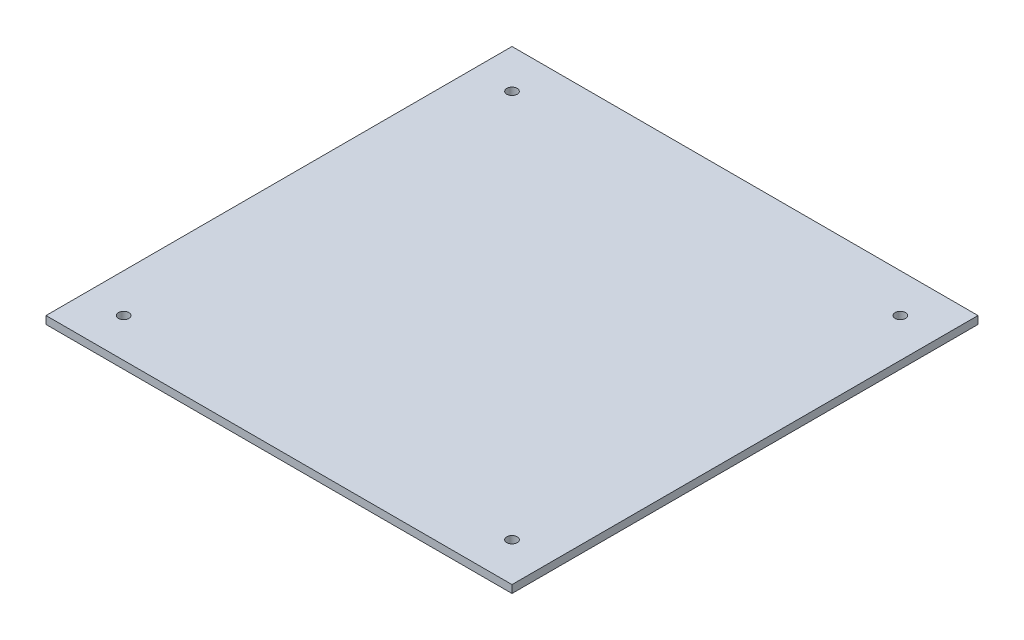
ISO-10303-21;
HEADER;
FILE_DESCRIPTION(('STEP AP214'),'2;1');
FILE_NAME('part.step','',(''),(''),'','','');
FILE_SCHEMA(('AUTOMOTIVE_DESIGN { 1 0 10303 214 1 1 1 1 }'));
ENDSEC;
DATA;
#1=APPLICATION_CONTEXT('core data for automotive mechanical design processes');
#2=APPLICATION_PROTOCOL_DEFINITION('international standard','automotive_design',2000,#1);
#3=PRODUCT_CONTEXT('',#1,'mechanical');
#4=PRODUCT('Part','Part','',(#3));
#5=PRODUCT_RELATED_PRODUCT_CATEGORY('part','',(#4));
#6=PRODUCT_DEFINITION_FORMATION('','',#4);
#7=PRODUCT_DEFINITION_CONTEXT('part definition',#1,'design');
#8=PRODUCT_DEFINITION('design','',#6,#7);
#9=PRODUCT_DEFINITION_SHAPE('','',#8);
#10=(LENGTH_UNIT() NAMED_UNIT(*) SI_UNIT(.MILLI.,.METRE.));
#11=(NAMED_UNIT(*) PLANE_ANGLE_UNIT() SI_UNIT($,.RADIAN.));
#12=(NAMED_UNIT(*) SI_UNIT($,.STERADIAN.) SOLID_ANGLE_UNIT());
#13=UNCERTAINTY_MEASURE_WITH_UNIT(LENGTH_MEASURE(1.E-05),#10,'distance_accuracy_value','');
#14=(GEOMETRIC_REPRESENTATION_CONTEXT(3) GLOBAL_UNCERTAINTY_ASSIGNED_CONTEXT((#13)) GLOBAL_UNIT_ASSIGNED_CONTEXT((#10,
#11,#12)) REPRESENTATION_CONTEXT('',''));
#15=CARTESIAN_POINT('',(0.,0.,0.));
#16=DIRECTION('',(0.,0.,1.));
#17=DIRECTION('',(1.,0.,0.));
#18=AXIS2_PLACEMENT_3D('',#15,#16,#17);
#19=CARTESIAN_POINT('',(0.,3.,0.));
#20=DIRECTION('',(0.,1.,0.));
#21=DIRECTION('',(0.,0.,1.));
#22=AXIS2_PLACEMENT_3D('',#19,#20,#21);
#23=PLANE('',#22);
#24=CARTESIAN_POINT('',(-74.9999999999999,3.,75.));
#25=DIRECTION('',(0.,1.,0.));
#26=DIRECTION('',(0.,0.,1.));
#27=AXIS2_PLACEMENT_3D('',#24,#25,#26);
#28=CIRCLE('',#27,2.);
#29=CARTESIAN_POINT('',(-74.9999999999999,3.,77.));
#30=VERTEX_POINT('',#29);
#31=EDGE_CURVE('E142',#30,#30,#28,.T.);
#32=ORIENTED_EDGE('',*,*,#31,.F.);
#33=EDGE_LOOP('',(#32));
#34=FACE_BOUND('',#33,.T.);
#35=CARTESIAN_POINT('',(-75.,3.,-75.));
#36=DIRECTION('',(0.,1.,0.));
#37=DIRECTION('',(0.,0.,1.));
#38=AXIS2_PLACEMENT_3D('',#35,#36,#37);
#39=CIRCLE('',#38,2.);
#40=CARTESIAN_POINT('',(-75.,3.,-73.));
#41=VERTEX_POINT('',#40);
#42=EDGE_CURVE('E112',#41,#41,#39,.T.);
#43=ORIENTED_EDGE('',*,*,#42,.F.);
#44=EDGE_LOOP('',(#43));
#45=FACE_BOUND('',#44,.T.);
#46=DIRECTION('',(0.,0.,1.));
#47=VECTOR('',#46,1.);
#48=CARTESIAN_POINT('',(-90.,3.,90.));
#49=LINE('',#48,#47);
#50=CARTESIAN_POINT('',(-90.,3.,-90.));
#51=VERTEX_POINT('',#50);
#52=CARTESIAN_POINT('',(-90.,3.,90.));
#53=VERTEX_POINT('',#52);
#54=EDGE_CURVE('E92',#51,#53,#49,.T.);
#55=ORIENTED_EDGE('',*,*,#54,.T.);
#56=DIRECTION('',(1.,0.,0.));
#57=VECTOR('',#56,1.);
#58=CARTESIAN_POINT('',(90.,3.,90.));
#59=LINE('',#58,#57);
#60=CARTESIAN_POINT('',(90.,3.,90.));
#61=VERTEX_POINT('',#60);
#62=EDGE_CURVE('E87',#53,#61,#59,.T.);
#63=ORIENTED_EDGE('',*,*,#62,.T.);
#64=DIRECTION('',(0.,0.,-1.));
#65=VECTOR('',#64,1.);
#66=CARTESIAN_POINT('',(90.,3.,90.));
#67=LINE('',#66,#65);
#68=CARTESIAN_POINT('',(90.,3.,-90.));
#69=VERTEX_POINT('',#68);
#70=EDGE_CURVE('E90',#61,#69,#67,.T.);
#71=ORIENTED_EDGE('',*,*,#70,.T.);
#72=DIRECTION('',(-1.,0.,0.));
#73=VECTOR('',#72,1.);
#74=CARTESIAN_POINT('',(90.,3.,-90.));
#75=LINE('',#74,#73);
#76=EDGE_CURVE('E57',#69,#51,#75,.T.);
#77=ORIENTED_EDGE('',*,*,#76,.T.);
#78=EDGE_LOOP('',(#55,#63,#71,#77));
#79=FACE_BOUND('',#78,.T.);
#80=CARTESIAN_POINT('',(75.,3.,-75.));
#81=DIRECTION('',(0.,1.,0.));
#82=DIRECTION('',(0.,0.,1.));
#83=AXIS2_PLACEMENT_3D('',#80,#81,#82);
#84=CIRCLE('',#83,2.);
#85=CARTESIAN_POINT('',(75.,3.,-73.));
#86=VERTEX_POINT('',#85);
#87=EDGE_CURVE('E134',#86,#86,#84,.T.);
#88=ORIENTED_EDGE('',*,*,#87,.F.);
#89=EDGE_LOOP('',(#88));
#90=FACE_BOUND('',#89,.T.);
#91=CARTESIAN_POINT('',(75.,3.,75.));
#92=DIRECTION('',(0.,1.,0.));
#93=DIRECTION('',(0.,0.,1.));
#94=AXIS2_PLACEMENT_3D('',#91,#92,#93);
#95=CIRCLE('',#94,2.);
#96=CARTESIAN_POINT('',(75.,3.,77.));
#97=VERTEX_POINT('',#96);
#98=EDGE_CURVE('E150',#97,#97,#95,.T.);
#99=ORIENTED_EDGE('',*,*,#98,.F.);
#100=EDGE_LOOP('',(#99));
#101=FACE_BOUND('',#100,.T.);
#102=ADVANCED_FACE('F39',(#34,#45,#79,#90,#101),#23,.T.);
#103=CARTESIAN_POINT('',(0.,0.,0.));
#104=DIRECTION('',(0.,1.,0.));
#105=DIRECTION('',(0.,0.,1.));
#106=AXIS2_PLACEMENT_3D('',#103,#104,#105);
#107=PLANE('',#106);
#108=DIRECTION('',(0.,0.,1.));
#109=VECTOR('',#108,1.);
#110=CARTESIAN_POINT('',(-90.,0.,90.));
#111=LINE('',#110,#109);
#112=CARTESIAN_POINT('',(-90.,0.,-90.));
#113=VERTEX_POINT('',#112);
#114=CARTESIAN_POINT('',(-90.,0.,90.));
#115=VERTEX_POINT('',#114);
#116=EDGE_CURVE('E108',#113,#115,#111,.T.);
#117=ORIENTED_EDGE('',*,*,#116,.F.);
#118=DIRECTION('',(-1.,0.,0.));
#119=VECTOR('',#118,1.);
#120=CARTESIAN_POINT('',(90.,0.,-90.));
#121=LINE('',#120,#119);
#122=CARTESIAN_POINT('',(90.,0.,-90.));
#123=VERTEX_POINT('',#122);
#124=EDGE_CURVE('E80',#123,#113,#121,.T.);
#125=ORIENTED_EDGE('',*,*,#124,.F.);
#126=DIRECTION('',(0.,0.,-1.));
#127=VECTOR('',#126,1.);
#128=CARTESIAN_POINT('',(90.,0.,90.));
#129=LINE('',#128,#127);
#130=CARTESIAN_POINT('',(90.,0.,90.));
#131=VERTEX_POINT('',#130);
#132=EDGE_CURVE('E74',#131,#123,#129,.T.);
#133=ORIENTED_EDGE('',*,*,#132,.F.);
#134=DIRECTION('',(1.,0.,0.));
#135=VECTOR('',#134,1.);
#136=CARTESIAN_POINT('',(90.,0.,90.));
#137=LINE('',#136,#135);
#138=EDGE_CURVE('E97',#115,#131,#137,.T.);
#139=ORIENTED_EDGE('',*,*,#138,.F.);
#140=EDGE_LOOP('',(#117,#125,#133,#139));
#141=FACE_BOUND('',#140,.T.);
#142=CARTESIAN_POINT('',(-75.,0.,-75.));
#143=DIRECTION('',(0.,1.,0.));
#144=DIRECTION('',(0.,0.,1.));
#145=AXIS2_PLACEMENT_3D('',#142,#143,#144);
#146=CIRCLE('',#145,2.);
#147=CARTESIAN_POINT('',(-75.,0.,-73.));
#148=VERTEX_POINT('',#147);
#149=EDGE_CURVE('E130',#148,#148,#146,.T.);
#150=ORIENTED_EDGE('',*,*,#149,.T.);
#151=EDGE_LOOP('',(#150));
#152=FACE_BOUND('',#151,.T.);
#153=CARTESIAN_POINT('',(75.,0.,-75.));
#154=DIRECTION('',(0.,1.,0.));
#155=DIRECTION('',(0.,0.,1.));
#156=AXIS2_PLACEMENT_3D('',#153,#154,#155);
#157=CIRCLE('',#156,2.);
#158=CARTESIAN_POINT('',(75.,0.,-73.));
#159=VERTEX_POINT('',#158);
#160=EDGE_CURVE('E138',#159,#159,#157,.T.);
#161=ORIENTED_EDGE('',*,*,#160,.T.);
#162=EDGE_LOOP('',(#161));
#163=FACE_BOUND('',#162,.T.);
#164=CARTESIAN_POINT('',(-74.9999999999999,0.,75.));
#165=DIRECTION('',(0.,1.,0.));
#166=DIRECTION('',(0.,0.,1.));
#167=AXIS2_PLACEMENT_3D('',#164,#165,#166);
#168=CIRCLE('',#167,2.);
#169=CARTESIAN_POINT('',(-74.9999999999999,0.,77.));
#170=VERTEX_POINT('',#169);
#171=EDGE_CURVE('E146',#170,#170,#168,.T.);
#172=ORIENTED_EDGE('',*,*,#171,.T.);
#173=EDGE_LOOP('',(#172));
#174=FACE_BOUND('',#173,.T.);
#175=CARTESIAN_POINT('',(75.,0.,75.));
#176=DIRECTION('',(0.,1.,0.));
#177=DIRECTION('',(0.,0.,1.));
#178=AXIS2_PLACEMENT_3D('',#175,#176,#177);
#179=CIRCLE('',#178,2.);
#180=CARTESIAN_POINT('',(75.,0.,77.));
#181=VERTEX_POINT('',#180);
#182=EDGE_CURVE('E154',#181,#181,#179,.T.);
#183=ORIENTED_EDGE('',*,*,#182,.T.);
#184=EDGE_LOOP('',(#183));
#185=FACE_BOUND('',#184,.T.);
#186=ADVANCED_FACE('F125',(#141,#152,#163,#174,#185),#107,.F.);
#187=CARTESIAN_POINT('',(-90.,3.,90.));
#188=DIRECTION('',(1.,0.,0.));
#189=DIRECTION('',(0.,0.,-1.));
#190=AXIS2_PLACEMENT_3D('',#187,#188,#189);
#191=PLANE('',#190);
#192=ORIENTED_EDGE('',*,*,#116,.T.);
#193=DIRECTION('',(0.,-1.,0.));
#194=VECTOR('',#193,1.);
#195=CARTESIAN_POINT('',(-90.,3.,90.));
#196=LINE('',#195,#194);
#197=EDGE_CURVE('E11',#53,#115,#196,.T.);
#198=ORIENTED_EDGE('',*,*,#197,.F.);
#199=ORIENTED_EDGE('',*,*,#54,.F.);
#200=DIRECTION('',(0.,-1.,0.));
#201=VECTOR('',#200,1.);
#202=CARTESIAN_POINT('',(-90.,3.,-90.));
#203=LINE('',#202,#201);
#204=EDGE_CURVE('E104',#51,#113,#203,.T.);
#205=ORIENTED_EDGE('',*,*,#204,.T.);
#206=EDGE_LOOP('',(#192,#198,#199,#205));
#207=FACE_BOUND('',#206,.T.);
#208=ADVANCED_FACE('F41',(#207),#191,.F.);
#209=CARTESIAN_POINT('',(90.,3.,90.));
#210=DIRECTION('',(0.,0.,-1.));
#211=DIRECTION('',(-1.,0.,0.));
#212=AXIS2_PLACEMENT_3D('',#209,#210,#211);
#213=PLANE('',#212);
#214=ORIENTED_EDGE('',*,*,#138,.T.);
#215=DIRECTION('',(0.,-1.,0.));
#216=VECTOR('',#215,1.);
#217=CARTESIAN_POINT('',(90.,3.,90.));
#218=LINE('',#217,#216);
#219=EDGE_CURVE('E49',#61,#131,#218,.T.);
#220=ORIENTED_EDGE('',*,*,#219,.F.);
#221=ORIENTED_EDGE('',*,*,#62,.F.);
#222=ORIENTED_EDGE('',*,*,#197,.T.);
#223=EDGE_LOOP('',(#214,#220,#221,#222));
#224=FACE_BOUND('',#223,.T.);
#225=ADVANCED_FACE('F96',(#224),#213,.F.);
#226=CARTESIAN_POINT('',(90.,3.,90.));
#227=DIRECTION('',(-1.,0.,0.));
#228=DIRECTION('',(0.,0.,1.));
#229=AXIS2_PLACEMENT_3D('',#226,#227,#228);
#230=PLANE('',#229);
#231=ORIENTED_EDGE('',*,*,#132,.T.);
#232=DIRECTION('',(0.,-1.,0.));
#233=VECTOR('',#232,1.);
#234=CARTESIAN_POINT('',(90.,3.,-90.));
#235=LINE('',#234,#233);
#236=EDGE_CURVE('E99',#69,#123,#235,.T.);
#237=ORIENTED_EDGE('',*,*,#236,.F.);
#238=ORIENTED_EDGE('',*,*,#70,.F.);
#239=ORIENTED_EDGE('',*,*,#219,.T.);
#240=EDGE_LOOP('',(#231,#237,#238,#239));
#241=FACE_BOUND('',#240,.T.);
#242=ADVANCED_FACE('F100',(#241),#230,.F.);
#243=CARTESIAN_POINT('',(90.,3.,-90.));
#244=DIRECTION('',(0.,0.,1.));
#245=DIRECTION('',(1.,0.,0.));
#246=AXIS2_PLACEMENT_3D('',#243,#244,#245);
#247=PLANE('',#246);
#248=ORIENTED_EDGE('',*,*,#124,.T.);
#249=ORIENTED_EDGE('',*,*,#204,.F.);
#250=ORIENTED_EDGE('',*,*,#76,.F.);
#251=ORIENTED_EDGE('',*,*,#236,.T.);
#252=EDGE_LOOP('',(#248,#249,#250,#251));
#253=FACE_BOUND('',#252,.T.);
#254=ADVANCED_FACE('F122',(#253),#247,.F.);
#255=CARTESIAN_POINT('',(-75.,3.,-75.));
#256=DIRECTION('',(0.,-1.,0.));
#257=DIRECTION('',(0.,0.,-1.));
#258=AXIS2_PLACEMENT_3D('',#255,#256,#257);
#259=CYLINDRICAL_SURFACE('',#258,2.);
#260=ORIENTED_EDGE('',*,*,#42,.T.);
#261=EDGE_LOOP('',(#260));
#262=FACE_BOUND('',#261,.T.);
#263=ORIENTED_EDGE('',*,*,#149,.F.);
#264=EDGE_LOOP('',(#263));
#265=FACE_BOUND('',#264,.T.);
#266=ADVANCED_FACE('F175',(#262,#265),#259,.F.);
#267=CARTESIAN_POINT('',(75.,3.,-75.));
#268=DIRECTION('',(0.,-1.,0.));
#269=DIRECTION('',(0.,0.,-1.));
#270=AXIS2_PLACEMENT_3D('',#267,#268,#269);
#271=CYLINDRICAL_SURFACE('',#270,2.);
#272=ORIENTED_EDGE('',*,*,#87,.T.);
#273=EDGE_LOOP('',(#272));
#274=FACE_BOUND('',#273,.T.);
#275=ORIENTED_EDGE('',*,*,#160,.F.);
#276=EDGE_LOOP('',(#275));
#277=FACE_BOUND('',#276,.T.);
#278=ADVANCED_FACE('F221',(#274,#277),#271,.F.);
#279=CARTESIAN_POINT('',(-74.9999999999999,3.,75.));
#280=DIRECTION('',(0.,-1.,0.));
#281=DIRECTION('',(0.,0.,-1.));
#282=AXIS2_PLACEMENT_3D('',#279,#280,#281);
#283=CYLINDRICAL_SURFACE('',#282,2.);
#284=ORIENTED_EDGE('',*,*,#31,.T.);
#285=EDGE_LOOP('',(#284));
#286=FACE_BOUND('',#285,.T.);
#287=ORIENTED_EDGE('',*,*,#171,.F.);
#288=EDGE_LOOP('',(#287));
#289=FACE_BOUND('',#288,.T.);
#290=ADVANCED_FACE('F229',(#286,#289),#283,.F.);
#291=CARTESIAN_POINT('',(75.,3.,75.));
#292=DIRECTION('',(0.,-1.,0.));
#293=DIRECTION('',(0.,0.,-1.));
#294=AXIS2_PLACEMENT_3D('',#291,#292,#293);
#295=CYLINDRICAL_SURFACE('',#294,2.);
#296=ORIENTED_EDGE('',*,*,#98,.T.);
#297=EDGE_LOOP('',(#296));
#298=FACE_BOUND('',#297,.T.);
#299=ORIENTED_EDGE('',*,*,#182,.F.);
#300=EDGE_LOOP('',(#299));
#301=FACE_BOUND('',#300,.T.);
#302=ADVANCED_FACE('F162',(#298,#301),#295,.F.);
#303=CLOSED_SHELL('',(#102,#186,#208,#225,#242,#254,#266,#278,#290,#302));
#304=MANIFOLD_SOLID_BREP('B2',#303);
#305=ADVANCED_BREP_SHAPE_REPRESENTATION('',(#18,#304),#14);
#306=SHAPE_DEFINITION_REPRESENTATION(#9,#305);
ENDSEC;
END-ISO-10303-21;
